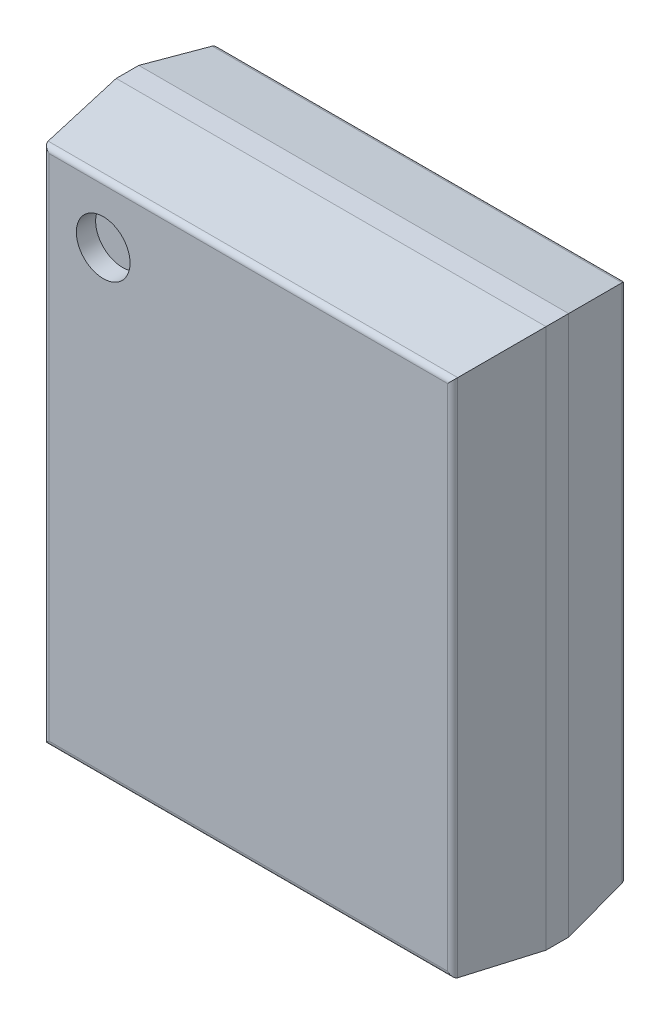
ISO-10303-21;
HEADER;
FILE_DESCRIPTION(('STEP AP214'),'2;1');
FILE_NAME('part.step','',(''),(''),'','','');
FILE_SCHEMA(('AUTOMOTIVE_DESIGN { 1 0 10303 214 1 1 1 1 }'));
ENDSEC;
DATA;
#1=APPLICATION_CONTEXT('core data for automotive mechanical design processes');
#2=APPLICATION_PROTOCOL_DEFINITION('international standard','automotive_design',2000,#1);
#3=PRODUCT_CONTEXT('',#1,'mechanical');
#4=PRODUCT('Part','Part','',(#3));
#5=PRODUCT_RELATED_PRODUCT_CATEGORY('part','',(#4));
#6=PRODUCT_DEFINITION_FORMATION('','',#4);
#7=PRODUCT_DEFINITION_CONTEXT('part definition',#1,'design');
#8=PRODUCT_DEFINITION('design','',#6,#7);
#9=PRODUCT_DEFINITION_SHAPE('','',#8);
#10=(LENGTH_UNIT() NAMED_UNIT(*) SI_UNIT(.MILLI.,.METRE.));
#11=(NAMED_UNIT(*) PLANE_ANGLE_UNIT() SI_UNIT($,.RADIAN.));
#12=(NAMED_UNIT(*) SI_UNIT($,.STERADIAN.) SOLID_ANGLE_UNIT());
#13=UNCERTAINTY_MEASURE_WITH_UNIT(LENGTH_MEASURE(1.E-05),#10,'distance_accuracy_value','');
#14=(GEOMETRIC_REPRESENTATION_CONTEXT(3) GLOBAL_UNCERTAINTY_ASSIGNED_CONTEXT((#13)) GLOBAL_UNIT_ASSIGNED_CONTEXT((#10,
#11,#12)) REPRESENTATION_CONTEXT('',''));
#15=CARTESIAN_POINT('',(0.,0.,0.));
#16=DIRECTION('',(0.,0.,1.));
#17=DIRECTION('',(1.,0.,0.));
#18=AXIS2_PLACEMENT_3D('',#15,#16,#17);
#19=CARTESIAN_POINT('',(-1.315,1.815,1.575));
#20=DIRECTION('',(0.,0.,1.));
#21=DIRECTION('',(1.,0.,0.));
#22=AXIS2_PLACEMENT_3D('',#19,#20,#21);
#23=PLANE('',#22);
#24=CARTESIAN_POINT('',(-1.315,1.815,1.575));
#25=DIRECTION('',(0.,0.,1.));
#26=DIRECTION('',(1.,0.,0.));
#27=AXIS2_PLACEMENT_3D('',#24,#25,#26);
#28=CIRCLE('',#27,0.24375);
#29=CARTESIAN_POINT('',(-1.07125,1.815,1.575));
#30=VERTEX_POINT('',#29);
#31=EDGE_CURVE('E11',#30,#30,#28,.T.);
#32=ORIENTED_EDGE('',*,*,#31,.T.);
#33=EDGE_LOOP('',(#32));
#34=FACE_BOUND('',#33,.T.);
#35=ADVANCED_FACE('F17',(#34),#23,.T.);
#36=CARTESIAN_POINT('',(-1.315,1.815,1.575));
#37=DIRECTION('',(0.,0.,1.));
#38=DIRECTION('',(1.,0.,0.));
#39=AXIS2_PLACEMENT_3D('',#36,#37,#38);
#40=CYLINDRICAL_SURFACE('',#39,0.24375);
#41=CARTESIAN_POINT('',(-1.315,1.815,1.75));
#42=DIRECTION('',(0.,0.,1.));
#43=DIRECTION('',(1.,0.,0.));
#44=AXIS2_PLACEMENT_3D('',#41,#42,#43);
#45=CIRCLE('',#44,0.24375);
#46=CARTESIAN_POINT('',(-1.07125,1.815,1.75));
#47=VERTEX_POINT('',#46);
#48=EDGE_CURVE('E316',#47,#47,#45,.T.);
#49=ORIENTED_EDGE('',*,*,#48,.T.);
#50=EDGE_LOOP('',(#49));
#51=FACE_BOUND('',#50,.T.);
#52=ORIENTED_EDGE('',*,*,#31,.F.);
#53=EDGE_LOOP('',(#52));
#54=FACE_BOUND('',#53,.T.);
#55=ADVANCED_FACE('F388',(#51,#54),#40,.F.);
#56=CARTESIAN_POINT('',(1.808558552786,-2.3525,1.7));
#57=DIRECTION('',(0.,1.,0.));
#58=DIRECTION('',(0.,0.,1.));
#59=AXIS2_PLACEMENT_3D('',#56,#57,#58);
#60=CYLINDRICAL_SURFACE('',#59,0.05);
#61=CARTESIAN_POINT('',(1.808558552786,-2.308558552786,1.7));
#62=DIRECTION('',(-0.707106781186548,-0.707106781186548,0.));
#63=DIRECTION('',(0.707106781186548,-0.707106781186548,0.));
#64=AXIS2_PLACEMENT_3D('',#61,#62,#63);
#65=ELLIPSE('',#64,0.07071067811865,0.05);
#66=CARTESIAN_POINT('',(1.858144342698,-2.358144342698,1.706422572601));
#67=VERTEX_POINT('',#66);
#68=CARTESIAN_POINT('',(1.808558552786,-2.308558552786,1.75));
#69=VERTEX_POINT('',#68);
#70=EDGE_CURVE('E188',#67,#69,#65,.T.);
#71=ORIENTED_EDGE('',*,*,#70,.F.);
#72=DIRECTION('',(0.,1.,0.));
#73=VECTOR('',#72,1.);
#74=CARTESIAN_POINT('',(1.858144342698,-2.3525,1.706422572601));
#75=LINE('',#74,#73);
#76=CARTESIAN_POINT('',(1.858144342698,2.358144342698,1.706422572601));
#77=VERTEX_POINT('',#76);
#78=EDGE_CURVE('E186',#67,#77,#75,.T.);
#79=ORIENTED_EDGE('',*,*,#78,.T.);
#80=CARTESIAN_POINT('',(1.808558552786,2.308558552786,1.7));
#81=DIRECTION('',(-0.707106781186548,0.707106781186548,0.));
#82=DIRECTION('',(0.707106781186548,0.707106781186548,0.));
#83=AXIS2_PLACEMENT_3D('',#80,#81,#82);
#84=ELLIPSE('',#83,0.07071067811865,0.05);
#85=CARTESIAN_POINT('',(1.808558552786,2.308558552786,1.75));
#86=VERTEX_POINT('',#85);
#87=EDGE_CURVE('E20',#86,#77,#84,.T.);
#88=ORIENTED_EDGE('',*,*,#87,.F.);
#89=DIRECTION('',(0.,1.,0.));
#90=VECTOR('',#89,1.);
#91=CARTESIAN_POINT('',(1.808558552786,-2.3525,1.75));
#92=LINE('',#91,#90);
#93=EDGE_CURVE('E44',#69,#86,#92,.T.);
#94=ORIENTED_EDGE('',*,*,#93,.F.);
#95=EDGE_LOOP('',(#71,#79,#88,#94));
#96=FACE_BOUND('',#95,.T.);
#97=ADVANCED_FACE('F330',(#96),#60,.T.);
#98=CARTESIAN_POINT('',(-1.8525,2.308558552786,1.7));
#99=DIRECTION('',(1.,0.,0.));
#100=DIRECTION('',(0.,0.,1.));
#101=AXIS2_PLACEMENT_3D('',#98,#99,#100);
#102=CYLINDRICAL_SURFACE('',#101,0.05);
#103=DIRECTION('',(1.,0.,0.));
#104=VECTOR('',#103,1.);
#105=CARTESIAN_POINT('',(-1.8525,2.308558552786,1.75));
#106=LINE('',#105,#104);
#107=CARTESIAN_POINT('',(-1.808558552786,2.308558552786,1.75));
#108=VERTEX_POINT('',#107);
#109=EDGE_CURVE('E314',#108,#86,#106,.T.);
#110=ORIENTED_EDGE('',*,*,#109,.T.);
#111=ORIENTED_EDGE('',*,*,#87,.T.);
#112=DIRECTION('',(1.,0.,0.));
#113=VECTOR('',#112,1.);
#114=CARTESIAN_POINT('',(-1.8525,2.358144342698,1.706422572601));
#115=LINE('',#114,#113);
#116=CARTESIAN_POINT('',(-1.858144342698,2.358144342698,1.706422572601));
#117=VERTEX_POINT('',#116);
#118=EDGE_CURVE('E293',#117,#77,#115,.T.);
#119=ORIENTED_EDGE('',*,*,#118,.F.);
#120=CARTESIAN_POINT('',(-1.808558552786,2.308558552786,1.7));
#121=DIRECTION('',(0.707106781186548,0.707106781186548,0.));
#122=DIRECTION('',(-0.707106781186548,0.707106781186548,0.));
#123=AXIS2_PLACEMENT_3D('',#120,#121,#122);
#124=ELLIPSE('',#123,0.07071067811865,0.05);
#125=EDGE_CURVE('E289',#117,#108,#124,.T.);
#126=ORIENTED_EDGE('',*,*,#125,.T.);
#127=EDGE_LOOP('',(#110,#111,#119,#126));
#128=FACE_BOUND('',#127,.T.);
#129=ADVANCED_FACE('F327',(#128),#102,.T.);
#130=CARTESIAN_POINT('',(-1.95,-2.45,1.75));
#131=DIRECTION('',(0.,0.,1.));
#132=DIRECTION('',(1.,0.,0.));
#133=AXIS2_PLACEMENT_3D('',#130,#131,#132);
#134=PLANE('',#133);
#135=ORIENTED_EDGE('',*,*,#48,.F.);
#136=EDGE_LOOP('',(#135));
#137=FACE_BOUND('',#136,.T.);
#138=DIRECTION('',(0.,1.,0.));
#139=VECTOR('',#138,1.);
#140=CARTESIAN_POINT('',(-1.808558552786,-2.3525,1.75));
#141=LINE('',#140,#139);
#142=CARTESIAN_POINT('',(-1.808558552786,-2.308558552786,1.75));
#143=VERTEX_POINT('',#142);
#144=EDGE_CURVE('E282',#143,#108,#141,.T.);
#145=ORIENTED_EDGE('',*,*,#144,.F.);
#146=DIRECTION('',(1.,0.,0.));
#147=VECTOR('',#146,1.);
#148=CARTESIAN_POINT('',(-1.8525,-2.308558552786,1.75));
#149=LINE('',#148,#147);
#150=EDGE_CURVE('E309',#143,#69,#149,.T.);
#151=ORIENTED_EDGE('',*,*,#150,.T.);
#152=ORIENTED_EDGE('',*,*,#93,.T.);
#153=ORIENTED_EDGE('',*,*,#109,.F.);
#154=EDGE_LOOP('',(#145,#151,#152,#153));
#155=FACE_BOUND('',#154,.T.);
#156=ADVANCED_FACE('F344',(#137,#155),#134,.T.);
#157=CARTESIAN_POINT('',(-1.8525,-2.308558552786,1.7));
#158=DIRECTION('',(1.,0.,0.));
#159=DIRECTION('',(0.,-0.991715798237691,0.12845145201896));
#160=AXIS2_PLACEMENT_3D('',#157,#158,#159);
#161=CYLINDRICAL_SURFACE('',#160,0.05);
#162=DIRECTION('',(1.,0.,0.));
#163=VECTOR('',#162,1.);
#164=CARTESIAN_POINT('',(-1.8525,-2.358144342698,1.706422572601));
#165=LINE('',#164,#163);
#166=CARTESIAN_POINT('',(-1.858144342698,-2.358144342698,1.706422572601));
#167=VERTEX_POINT('',#166);
#168=EDGE_CURVE('E265',#167,#67,#165,.T.);
#169=ORIENTED_EDGE('',*,*,#168,.T.);
#170=ORIENTED_EDGE('',*,*,#70,.T.);
#171=ORIENTED_EDGE('',*,*,#150,.F.);
#172=CARTESIAN_POINT('',(-1.808558552786,-2.308558552786,1.7));
#173=DIRECTION('',(-0.707106781186548,0.707106781186548,0.));
#174=DIRECTION('',(0.707106781186548,0.707106781186548,0.));
#175=AXIS2_PLACEMENT_3D('',#172,#173,#174);
#176=ELLIPSE('',#175,0.07071067811865,0.05);
#177=EDGE_CURVE('E278',#167,#143,#176,.T.);
#178=ORIENTED_EDGE('',*,*,#177,.F.);
#179=EDGE_LOOP('',(#169,#170,#171,#178));
#180=FACE_BOUND('',#179,.T.);
#181=ADVANCED_FACE('F346',(#180),#161,.T.);
#182=CARTESIAN_POINT('',(1.90125,-2.45,1.373623210137));
#183=DIRECTION('',(0.991715798237691,0.,0.12845145201896));
#184=DIRECTION('',(0.,-1.,0.));
#185=AXIS2_PLACEMENT_3D('',#182,#183,#184);
#186=PLANE('',#185);
#187=DIRECTION('',(-0.12740467794397,0.12740467794397,0.983634127140771));
#188=VECTOR('',#187,1.);
#189=CARTESIAN_POINT('',(1.870389001332,-2.370389001332,1.611887079072));
#190=LINE('',#189,#188);
#191=CARTESIAN_POINT('',(1.95,-2.45,0.997246420274));
#192=VERTEX_POINT('',#191);
#193=EDGE_CURVE('E241',#192,#67,#190,.T.);
#194=ORIENTED_EDGE('',*,*,#193,.F.);
#195=DIRECTION('',(0.,1.,0.));
#196=VECTOR('',#195,1.);
#197=CARTESIAN_POINT('',(1.95,-2.45,0.997246420274));
#198=LINE('',#197,#196);
#199=CARTESIAN_POINT('',(1.95,2.45,0.997246420274));
#200=VERTEX_POINT('',#199);
#201=EDGE_CURVE('E237',#192,#200,#198,.T.);
#202=ORIENTED_EDGE('',*,*,#201,.T.);
#203=DIRECTION('',(-0.12740467794397,-0.12740467794397,0.983634127140771));
#204=VECTOR('',#203,1.);
#205=CARTESIAN_POINT('',(1.830620719025,2.330620719025,1.91892007257));
#206=LINE('',#205,#204);
#207=EDGE_CURVE('E189',#200,#77,#206,.T.);
#208=ORIENTED_EDGE('',*,*,#207,.T.);
#209=ORIENTED_EDGE('',*,*,#78,.F.);
#210=EDGE_LOOP('',(#194,#202,#208,#209));
#211=FACE_BOUND('',#210,.T.);
#212=ADVANCED_FACE('F332',(#211),#186,.T.);
#213=CARTESIAN_POINT('',(-1.95,2.40125,1.373623210137));
#214=DIRECTION('',(0.,0.991715798237691,0.12845145201896));
#215=DIRECTION('',(1.,0.,0.));
#216=AXIS2_PLACEMENT_3D('',#213,#214,#215);
#217=PLANE('',#216);
#218=ORIENTED_EDGE('',*,*,#118,.T.);
#219=ORIENTED_EDGE('',*,*,#207,.F.);
#220=DIRECTION('',(1.,0.,0.));
#221=VECTOR('',#220,1.);
#222=CARTESIAN_POINT('',(-1.95,2.45,0.997246420274));
#223=LINE('',#222,#221);
#224=CARTESIAN_POINT('',(-1.95,2.45,0.997246420274));
#225=VERTEX_POINT('',#224);
#226=EDGE_CURVE('E242',#225,#200,#223,.T.);
#227=ORIENTED_EDGE('',*,*,#226,.F.);
#228=DIRECTION('',(0.12740467794397,-0.12740467794397,0.983634127140771));
#229=VECTOR('',#228,1.);
#230=CARTESIAN_POINT('',(-1.862273025351,2.362273025351,1.674546873663));
#231=LINE('',#230,#229);
#232=EDGE_CURVE('E269',#225,#117,#231,.T.);
#233=ORIENTED_EDGE('',*,*,#232,.T.);
#234=EDGE_LOOP('',(#218,#219,#227,#233));
#235=FACE_BOUND('',#234,.T.);
#236=ADVANCED_FACE('F335',(#235),#217,.T.);
#237=CARTESIAN_POINT('',(-1.808558552786,-2.3525,1.7));
#238=DIRECTION('',(0.,1.,0.));
#239=DIRECTION('',(-0.991715798237691,0.,0.12845145201896));
#240=AXIS2_PLACEMENT_3D('',#237,#238,#239);
#241=CYLINDRICAL_SURFACE('',#240,0.05);
#242=ORIENTED_EDGE('',*,*,#177,.T.);
#243=ORIENTED_EDGE('',*,*,#144,.T.);
#244=ORIENTED_EDGE('',*,*,#125,.F.);
#245=DIRECTION('',(0.,1.,0.));
#246=VECTOR('',#245,1.);
#247=CARTESIAN_POINT('',(-1.858144342698,-2.3525,1.706422572601));
#248=LINE('',#247,#246);
#249=EDGE_CURVE('E246',#167,#117,#248,.T.);
#250=ORIENTED_EDGE('',*,*,#249,.F.);
#251=EDGE_LOOP('',(#242,#243,#244,#250));
#252=FACE_BOUND('',#251,.T.);
#253=ADVANCED_FACE('F341',(#252),#241,.T.);
#254=CARTESIAN_POINT('',(-1.95,-2.40125,1.373623210137));
#255=DIRECTION('',(0.,0.991715798237691,-0.12845145201896));
#256=DIRECTION('',(-1.,0.,0.));
#257=AXIS2_PLACEMENT_3D('',#254,#255,#256);
#258=PLANE('',#257);
#259=DIRECTION('',(0.12740467794397,0.12740467794397,0.983634127140771));
#260=VECTOR('',#259,1.);
#261=CARTESIAN_POINT('',(-1.902041307658,-2.402041307658,1.367513880164));
#262=LINE('',#261,#260);
#263=CARTESIAN_POINT('',(-1.95,-2.45,0.997246420274));
#264=VERTEX_POINT('',#263);
#265=EDGE_CURVE('E273',#264,#167,#262,.T.);
#266=ORIENTED_EDGE('',*,*,#265,.F.);
#267=DIRECTION('',(1.,0.,0.));
#268=VECTOR('',#267,1.);
#269=CARTESIAN_POINT('',(-1.95,-2.45,0.997246420274));
#270=LINE('',#269,#268);
#271=EDGE_CURVE('E143',#264,#192,#270,.T.);
#272=ORIENTED_EDGE('',*,*,#271,.T.);
#273=ORIENTED_EDGE('',*,*,#193,.T.);
#274=ORIENTED_EDGE('',*,*,#168,.F.);
#275=EDGE_LOOP('',(#266,#272,#273,#274));
#276=FACE_BOUND('',#275,.T.);
#277=ADVANCED_FACE('F349',(#276),#258,.F.);
#278=CARTESIAN_POINT('',(1.95,-2.45,0.175));
#279=DIRECTION('',(1.,0.,0.));
#280=DIRECTION('',(0.,1.,0.));
#281=AXIS2_PLACEMENT_3D('',#278,#279,#280);
#282=PLANE('',#281);
#283=DIRECTION('',(0.,0.,1.));
#284=VECTOR('',#283,1.);
#285=CARTESIAN_POINT('',(1.95,-2.45,0.175));
#286=LINE('',#285,#284);
#287=CARTESIAN_POINT('',(1.95,-2.45,0.792246420274));
#288=VERTEX_POINT('',#287);
#289=EDGE_CURVE('E250',#288,#192,#286,.T.);
#290=ORIENTED_EDGE('',*,*,#289,.F.);
#291=DIRECTION('',(0.,1.,0.));
#292=VECTOR('',#291,1.);
#293=CARTESIAN_POINT('',(1.95,-2.45,0.792246420274));
#294=LINE('',#293,#292);
#295=CARTESIAN_POINT('',(1.95,2.45,0.792246420274));
#296=VERTEX_POINT('',#295);
#297=EDGE_CURVE('E196',#288,#296,#294,.T.);
#298=ORIENTED_EDGE('',*,*,#297,.T.);
#299=DIRECTION('',(0.,0.,1.));
#300=VECTOR('',#299,1.);
#301=CARTESIAN_POINT('',(1.95,2.45,0.175));
#302=LINE('',#301,#300);
#303=EDGE_CURVE('E277',#296,#200,#302,.T.);
#304=ORIENTED_EDGE('',*,*,#303,.T.);
#305=ORIENTED_EDGE('',*,*,#201,.F.);
#306=EDGE_LOOP('',(#290,#298,#304,#305));
#307=FACE_BOUND('',#306,.T.);
#308=ADVANCED_FACE('F352',(#307),#282,.T.);
#309=CARTESIAN_POINT('',(1.809778042507,-2.3525,0.225));
#310=DIRECTION('',(0.,1.,0.));
#311=DIRECTION('',(0.,0.,-1.));
#312=AXIS2_PLACEMENT_3D('',#309,#310,#311);
#313=CYLINDRICAL_SURFACE('',#312,0.05);
#314=DIRECTION('',(0.,1.,0.));
#315=VECTOR('',#314,1.);
#316=CARTESIAN_POINT('',(1.809778042507,-2.3525,0.175));
#317=LINE('',#316,#315);
#318=CARTESIAN_POINT('',(1.809778042507,-2.309778042507,0.175));
#319=VERTEX_POINT('',#318);
#320=CARTESIAN_POINT('',(1.809778042507,2.309778042507,0.175));
#321=VERTEX_POINT('',#320);
#322=EDGE_CURVE('E247',#319,#321,#317,.T.);
#323=ORIENTED_EDGE('',*,*,#322,.T.);
#324=CARTESIAN_POINT('',(1.809778042507,2.309778042507,0.225));
#325=DIRECTION('',(0.707106781186548,-0.707106781186548,0.));
#326=DIRECTION('',(0.707106781186548,0.707106781186548,0.));
#327=AXIS2_PLACEMENT_3D('',#324,#325,#326);
#328=ELLIPSE('',#327,0.07071067811865,0.05);
#329=CARTESIAN_POINT('',(1.859165697143,2.359165697143,0.217198745641));
#330=VERTEX_POINT('',#329);
#331=EDGE_CURVE('E243',#321,#330,#328,.T.);
#332=ORIENTED_EDGE('',*,*,#331,.T.);
#333=DIRECTION('',(0.,1.,0.));
#334=VECTOR('',#333,1.);
#335=CARTESIAN_POINT('',(1.859165697143,-2.3525,0.217198745641));
#336=LINE('',#335,#334);
#337=CARTESIAN_POINT('',(1.859165697143,-2.359165697143,0.217198745641));
#338=VERTEX_POINT('',#337);
#339=EDGE_CURVE('E201',#338,#330,#336,.T.);
#340=ORIENTED_EDGE('',*,*,#339,.F.);
#341=CARTESIAN_POINT('',(1.809778042507,-2.309778042507,0.225));
#342=DIRECTION('',(0.707106781186548,0.707106781186548,0.));
#343=DIRECTION('',(0.707106781186548,-0.707106781186548,0.));
#344=AXIS2_PLACEMENT_3D('',#341,#342,#343);
#345=ELLIPSE('',#344,0.07071067811865,0.05);
#346=EDGE_CURVE('E219',#338,#319,#345,.T.);
#347=ORIENTED_EDGE('',*,*,#346,.T.);
#348=EDGE_LOOP('',(#323,#332,#340,#347));
#349=FACE_BOUND('',#348,.T.);
#350=ADVANCED_FACE('F373',(#349),#313,.T.);
#351=CARTESIAN_POINT('',(-1.95,2.45,0.175));
#352=DIRECTION('',(0.,1.,0.));
#353=DIRECTION('',(1.,0.,0.));
#354=AXIS2_PLACEMENT_3D('',#351,#352,#353);
#355=PLANE('',#354);
#356=ORIENTED_EDGE('',*,*,#303,.F.);
#357=DIRECTION('',(1.,0.,0.));
#358=VECTOR('',#357,1.);
#359=CARTESIAN_POINT('',(-1.95,2.45,0.792246420274));
#360=LINE('',#359,#358);
#361=CARTESIAN_POINT('',(-1.95,2.45,0.792246420274));
#362=VERTEX_POINT('',#361);
#363=EDGE_CURVE('E149',#362,#296,#360,.T.);
#364=ORIENTED_EDGE('',*,*,#363,.F.);
#365=DIRECTION('',(0.,0.,1.));
#366=VECTOR('',#365,1.);
#367=CARTESIAN_POINT('',(-1.95,2.45,0.175));
#368=LINE('',#367,#366);
#369=EDGE_CURVE('E150',#362,#225,#368,.T.);
#370=ORIENTED_EDGE('',*,*,#369,.T.);
#371=ORIENTED_EDGE('',*,*,#226,.T.);
#372=EDGE_LOOP('',(#356,#364,#370,#371));
#373=FACE_BOUND('',#372,.T.);
#374=ADVANCED_FACE('F355',(#373),#355,.T.);
#375=CARTESIAN_POINT('',(-1.90125,-2.45,1.373623210137));
#376=DIRECTION('',(0.991715798237691,0.,-0.12845145201896));
#377=DIRECTION('',(0.,-1.,0.));
#378=AXIS2_PLACEMENT_3D('',#375,#376,#377);
#379=PLANE('',#378);
#380=ORIENTED_EDGE('',*,*,#249,.T.);
#381=ORIENTED_EDGE('',*,*,#232,.F.);
#382=DIRECTION('',(0.,1.,0.));
#383=VECTOR('',#382,1.);
#384=CARTESIAN_POINT('',(-1.95,-2.45,0.997246420274));
#385=LINE('',#384,#383);
#386=EDGE_CURVE('E223',#264,#225,#385,.T.);
#387=ORIENTED_EDGE('',*,*,#386,.F.);
#388=ORIENTED_EDGE('',*,*,#265,.T.);
#389=EDGE_LOOP('',(#380,#381,#387,#388));
#390=FACE_BOUND('',#389,.T.);
#391=ADVANCED_FACE('F339',(#390),#379,.F.);
#392=CARTESIAN_POINT('',(-1.8525,2.309778042507,0.225));
#393=DIRECTION('',(1.,0.,0.));
#394=DIRECTION('',(0.,0.,-1.));
#395=AXIS2_PLACEMENT_3D('',#392,#393,#394);
#396=CYLINDRICAL_SURFACE('',#395,0.05);
#397=CARTESIAN_POINT('',(-1.809778042507,2.309778042507,0.225));
#398=DIRECTION('',(-0.707106781186548,-0.707106781186548,0.));
#399=DIRECTION('',(-0.707106781186548,0.707106781186548,0.));
#400=AXIS2_PLACEMENT_3D('',#397,#398,#399);
#401=ELLIPSE('',#400,0.07071067811865,0.05);
#402=CARTESIAN_POINT('',(-1.859165697143,2.359165697143,0.217198745641));
#403=VERTEX_POINT('',#402);
#404=CARTESIAN_POINT('',(-1.809778042507,2.309778042507,0.175));
#405=VERTEX_POINT('',#404);
#406=EDGE_CURVE('E161',#403,#405,#401,.T.);
#407=ORIENTED_EDGE('',*,*,#406,.F.);
#408=DIRECTION('',(1.,0.,0.));
#409=VECTOR('',#408,1.);
#410=CARTESIAN_POINT('',(-1.8525,2.359165697143,0.217198745641));
#411=LINE('',#410,#409);
#412=EDGE_CURVE('E208',#403,#330,#411,.T.);
#413=ORIENTED_EDGE('',*,*,#412,.T.);
#414=ORIENTED_EDGE('',*,*,#331,.F.);
#415=DIRECTION('',(1.,0.,0.));
#416=VECTOR('',#415,1.);
#417=CARTESIAN_POINT('',(-1.8525,2.309778042507,0.175));
#418=LINE('',#417,#416);
#419=EDGE_CURVE('E200',#405,#321,#418,.T.);
#420=ORIENTED_EDGE('',*,*,#419,.F.);
#421=EDGE_LOOP('',(#407,#413,#414,#420));
#422=FACE_BOUND('',#421,.T.);
#423=ADVANCED_FACE('F360',(#422),#396,.T.);
#424=CARTESIAN_POINT('',(-1.95,-2.45,0.175));
#425=DIRECTION('',(0.,0.,1.));
#426=DIRECTION('',(1.,0.,0.));
#427=AXIS2_PLACEMENT_3D('',#424,#425,#426);
#428=PLANE('',#427);
#429=ORIENTED_EDGE('',*,*,#419,.T.);
#430=ORIENTED_EDGE('',*,*,#322,.F.);
#431=DIRECTION('',(1.,0.,0.));
#432=VECTOR('',#431,1.);
#433=CARTESIAN_POINT('',(-1.8525,-2.309778042507,0.175));
#434=LINE('',#433,#432);
#435=CARTESIAN_POINT('',(-1.809778042507,-2.309778042507,0.175));
#436=VERTEX_POINT('',#435);
#437=EDGE_CURVE('E215',#436,#319,#434,.T.);
#438=ORIENTED_EDGE('',*,*,#437,.F.);
#439=DIRECTION('',(0.,1.,0.));
#440=VECTOR('',#439,1.);
#441=CARTESIAN_POINT('',(-1.809778042507,-2.3525,0.175));
#442=LINE('',#441,#440);
#443=EDGE_CURVE('E214',#436,#405,#442,.T.);
#444=ORIENTED_EDGE('',*,*,#443,.T.);
#445=EDGE_LOOP('',(#429,#430,#438,#444));
#446=FACE_BOUND('',#445,.T.);
#447=ADVANCED_FACE('F375',(#446),#428,.F.);
#448=CARTESIAN_POINT('',(1.90125,-2.45,0.483623210137));
#449=DIRECTION('',(-0.987753092714965,0.,0.156025087187994));
#450=DIRECTION('',(0.,1.,0.));
#451=AXIS2_PLACEMENT_3D('',#448,#449,#450);
#452=PLANE('',#451);
#453=ORIENTED_EDGE('',*,*,#339,.T.);
#454=DIRECTION('',(-0.154159948465985,-0.154159948465985,-0.975945398358909));
#455=VECTOR('',#454,1.);
#456=CARTESIAN_POINT('',(1.797841283145,2.297841283145,-0.171029716054));
#457=LINE('',#456,#455);
#458=EDGE_CURVE('E204',#296,#330,#457,.T.);
#459=ORIENTED_EDGE('',*,*,#458,.F.);
#460=ORIENTED_EDGE('',*,*,#297,.F.);
#461=DIRECTION('',(-0.154159948465985,0.154159948465985,-0.975945398358909));
#462=VECTOR('',#461,1.);
#463=CARTESIAN_POINT('',(1.856066242937,-2.356066242937,0.197576930121));
#464=LINE('',#463,#462);
#465=EDGE_CURVE('E159',#288,#338,#464,.T.);
#466=ORIENTED_EDGE('',*,*,#465,.T.);
#467=EDGE_LOOP('',(#453,#459,#460,#466));
#468=FACE_BOUND('',#467,.T.);
#469=ADVANCED_FACE('F372',(#468),#452,.F.);
#470=CARTESIAN_POINT('',(-1.95,-2.45,0.175));
#471=DIRECTION('',(0.,1.,0.));
#472=DIRECTION('',(1.,0.,0.));
#473=AXIS2_PLACEMENT_3D('',#470,#471,#472);
#474=PLANE('',#473);
#475=ORIENTED_EDGE('',*,*,#271,.F.);
#476=DIRECTION('',(0.,0.,1.));
#477=VECTOR('',#476,1.);
#478=CARTESIAN_POINT('',(-1.95,-2.45,0.175));
#479=LINE('',#478,#477);
#480=CARTESIAN_POINT('',(-1.95,-2.45,0.792246420274));
#481=VERTEX_POINT('',#480);
#482=EDGE_CURVE('E136',#481,#264,#479,.T.);
#483=ORIENTED_EDGE('',*,*,#482,.F.);
#484=DIRECTION('',(1.,0.,0.));
#485=VECTOR('',#484,1.);
#486=CARTESIAN_POINT('',(-1.95,-2.45,0.792246420274));
#487=LINE('',#486,#485);
#488=EDGE_CURVE('E140',#481,#288,#487,.T.);
#489=ORIENTED_EDGE('',*,*,#488,.T.);
#490=ORIENTED_EDGE('',*,*,#289,.T.);
#491=EDGE_LOOP('',(#475,#483,#489,#490));
#492=FACE_BOUND('',#491,.T.);
#493=ADVANCED_FACE('F138',(#492),#474,.F.);
#494=CARTESIAN_POINT('',(-1.8525,-2.309778042507,0.225));
#495=DIRECTION('',(1.,0.,0.));
#496=DIRECTION('',(0.,-0.987753092714965,-0.156025087187994));
#497=AXIS2_PLACEMENT_3D('',#494,#495,#496);
#498=CYLINDRICAL_SURFACE('',#497,0.05);
#499=CARTESIAN_POINT('',(-1.809778042507,-2.309778042507,0.225));
#500=DIRECTION('',(0.707106781186548,-0.707106781186548,0.));
#501=DIRECTION('',(0.707106781186548,0.707106781186548,0.));
#502=AXIS2_PLACEMENT_3D('',#499,#500,#501);
#503=ELLIPSE('',#502,0.07071067811865,0.05);
#504=CARTESIAN_POINT('',(-1.859165697143,-2.359165697143,0.217198745641));
#505=VERTEX_POINT('',#504);
#506=EDGE_CURVE('E184',#505,#436,#503,.T.);
#507=ORIENTED_EDGE('',*,*,#506,.T.);
#508=ORIENTED_EDGE('',*,*,#437,.T.);
#509=ORIENTED_EDGE('',*,*,#346,.F.);
#510=DIRECTION('',(1.,0.,0.));
#511=VECTOR('',#510,1.);
#512=CARTESIAN_POINT('',(-1.8525,-2.359165697143,0.217198745641));
#513=LINE('',#512,#511);
#514=EDGE_CURVE('E195',#505,#338,#513,.T.);
#515=ORIENTED_EDGE('',*,*,#514,.F.);
#516=EDGE_LOOP('',(#507,#508,#509,#515));
#517=FACE_BOUND('',#516,.T.);
#518=ADVANCED_FACE('F369',(#517),#498,.T.);
#519=CARTESIAN_POINT('',(-1.95,2.40125,0.483623210137));
#520=DIRECTION('',(0.,-0.987753092714965,0.156025087187994));
#521=DIRECTION('',(-1.,0.,0.));
#522=AXIS2_PLACEMENT_3D('',#519,#520,#521);
#523=PLANE('',#522);
#524=DIRECTION('',(0.154159948465985,-0.154159948465985,-0.975945398358909));
#525=VECTOR('',#524,1.);
#526=CARTESIAN_POINT('',(-1.844183598082,2.344183598082,0.122351083963));
#527=LINE('',#526,#525);
#528=EDGE_CURVE('E172',#362,#403,#527,.T.);
#529=ORIENTED_EDGE('',*,*,#528,.F.);
#530=ORIENTED_EDGE('',*,*,#363,.T.);
#531=ORIENTED_EDGE('',*,*,#458,.T.);
#532=ORIENTED_EDGE('',*,*,#412,.F.);
#533=EDGE_LOOP('',(#529,#530,#531,#532));
#534=FACE_BOUND('',#533,.T.);
#535=ADVANCED_FACE('F357',(#534),#523,.F.);
#536=CARTESIAN_POINT('',(-1.95,-2.45,0.175));
#537=DIRECTION('',(1.,0.,0.));
#538=DIRECTION('',(0.,1.,0.));
#539=AXIS2_PLACEMENT_3D('',#536,#537,#538);
#540=PLANE('',#539);
#541=ORIENTED_EDGE('',*,*,#386,.T.);
#542=ORIENTED_EDGE('',*,*,#369,.F.);
#543=DIRECTION('',(0.,1.,0.));
#544=VECTOR('',#543,1.);
#545=CARTESIAN_POINT('',(-1.95,-2.45,0.792246420274));
#546=LINE('',#545,#544);
#547=EDGE_CURVE('E165',#481,#362,#546,.T.);
#548=ORIENTED_EDGE('',*,*,#547,.F.);
#549=ORIENTED_EDGE('',*,*,#482,.T.);
#550=EDGE_LOOP('',(#541,#542,#548,#549));
#551=FACE_BOUND('',#550,.T.);
#552=ADVANCED_FACE('F166',(#551),#540,.F.);
#553=CARTESIAN_POINT('',(-1.809778042507,-2.3525,0.225));
#554=DIRECTION('',(0.,1.,0.));
#555=DIRECTION('',(-0.987753092714965,0.,-0.156025087187994));
#556=AXIS2_PLACEMENT_3D('',#553,#554,#555);
#557=CYLINDRICAL_SURFACE('',#556,0.05);
#558=DIRECTION('',(0.,1.,0.));
#559=VECTOR('',#558,1.);
#560=CARTESIAN_POINT('',(-1.859165697143,-2.3525,0.217198745641));
#561=LINE('',#560,#559);
#562=EDGE_CURVE('E177',#505,#403,#561,.T.);
#563=ORIENTED_EDGE('',*,*,#562,.T.);
#564=ORIENTED_EDGE('',*,*,#406,.T.);
#565=ORIENTED_EDGE('',*,*,#443,.F.);
#566=ORIENTED_EDGE('',*,*,#506,.F.);
#567=EDGE_LOOP('',(#563,#564,#565,#566));
#568=FACE_BOUND('',#567,.T.);
#569=ADVANCED_FACE('F363',(#568),#557,.T.);
#570=CARTESIAN_POINT('',(-1.95,-2.40125,0.483623210137));
#571=DIRECTION('',(0.,-0.987753092714965,-0.156025087187994));
#572=DIRECTION('',(0.,0.156025087187994,-0.987753092714965));
#573=AXIS2_PLACEMENT_3D('',#570,#571,#572);
#574=PLANE('',#573);
#575=ORIENTED_EDGE('',*,*,#514,.T.);
#576=ORIENTED_EDGE('',*,*,#465,.F.);
#577=ORIENTED_EDGE('',*,*,#488,.F.);
#578=DIRECTION('',(0.154159948465985,0.154159948465985,-0.975945398358909));
#579=VECTOR('',#578,1.);
#580=CARTESIAN_POINT('',(-1.902408557873,-2.402408557873,0.490957730138));
#581=LINE('',#580,#579);
#582=EDGE_CURVE('E157',#481,#505,#581,.T.);
#583=ORIENTED_EDGE('',*,*,#582,.T.);
#584=EDGE_LOOP('',(#575,#576,#577,#583));
#585=FACE_BOUND('',#584,.T.);
#586=ADVANCED_FACE('F155',(#585),#574,.T.);
#587=CARTESIAN_POINT('',(-1.90125,-2.45,0.483623210137));
#588=DIRECTION('',(-0.987753092714965,0.,-0.156025087187994));
#589=DIRECTION('',(-0.156025087187994,0.,0.987753092714965));
#590=AXIS2_PLACEMENT_3D('',#587,#588,#589);
#591=PLANE('',#590);
#592=ORIENTED_EDGE('',*,*,#582,.F.);
#593=ORIENTED_EDGE('',*,*,#547,.T.);
#594=ORIENTED_EDGE('',*,*,#528,.T.);
#595=ORIENTED_EDGE('',*,*,#562,.F.);
#596=EDGE_LOOP('',(#592,#593,#594,#595));
#597=FACE_BOUND('',#596,.T.);
#598=ADVANCED_FACE('F175',(#597),#591,.T.);
#599=CLOSED_SHELL('',(#35,#55,#97,#129,#156,#181,#212,#236,#253,#277,#308,#350,#374,#391,#423,
#447,#469,#493,#518,#535,#552,#569,#586,#598));
#600=MANIFOLD_SOLID_BREP('B1',#599);
#601=ADVANCED_BREP_SHAPE_REPRESENTATION('',(#18,#600),#14);
#602=SHAPE_DEFINITION_REPRESENTATION(#9,#601);
ENDSEC;
END-ISO-10303-21;
